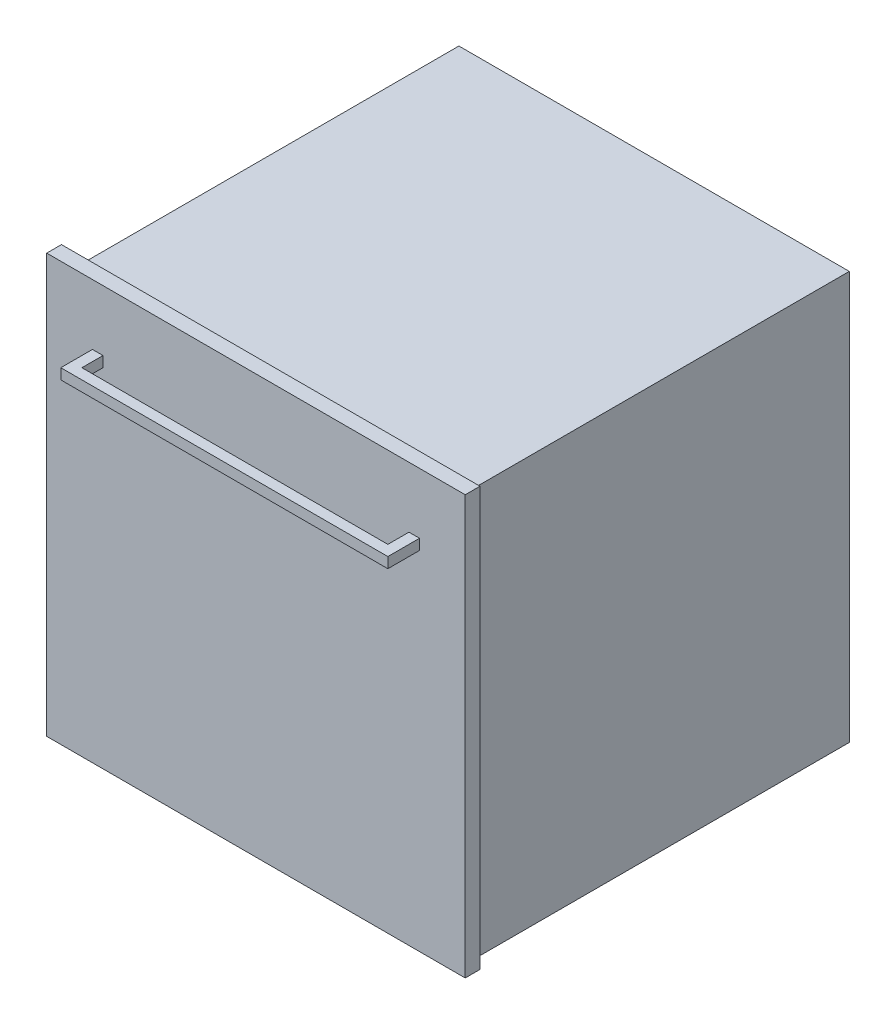
ISO-10303-21;
HEADER;
FILE_DESCRIPTION(('STEP AP214'),'2;1');
FILE_NAME('part.step','',(''),(''),'','','');
FILE_SCHEMA(('AUTOMOTIVE_DESIGN { 1 0 10303 214 1 1 1 1 }'));
ENDSEC;
DATA;
#1=APPLICATION_CONTEXT('core data for automotive mechanical design processes');
#2=APPLICATION_PROTOCOL_DEFINITION('international standard','automotive_design',2000,#1);
#3=PRODUCT_CONTEXT('',#1,'mechanical');
#4=PRODUCT('Part','Part','',(#3));
#5=PRODUCT_RELATED_PRODUCT_CATEGORY('part','',(#4));
#6=PRODUCT_DEFINITION_FORMATION('','',#4);
#7=PRODUCT_DEFINITION_CONTEXT('part definition',#1,'design');
#8=PRODUCT_DEFINITION('design','',#6,#7);
#9=PRODUCT_DEFINITION_SHAPE('','',#8);
#10=(LENGTH_UNIT() NAMED_UNIT(*) SI_UNIT(.MILLI.,.METRE.));
#11=(NAMED_UNIT(*) PLANE_ANGLE_UNIT() SI_UNIT($,.RADIAN.));
#12=(NAMED_UNIT(*) SI_UNIT($,.STERADIAN.) SOLID_ANGLE_UNIT());
#13=UNCERTAINTY_MEASURE_WITH_UNIT(LENGTH_MEASURE(1.E-05),#10,'distance_accuracy_value','');
#14=(GEOMETRIC_REPRESENTATION_CONTEXT(3) GLOBAL_UNCERTAINTY_ASSIGNED_CONTEXT((#13)) GLOBAL_UNIT_ASSIGNED_CONTEXT((#10,
#11,#12)) REPRESENTATION_CONTEXT('',''));
#15=CARTESIAN_POINT('',(0.,0.,0.));
#16=DIRECTION('',(0.,0.,1.));
#17=DIRECTION('',(1.,0.,0.));
#18=AXIS2_PLACEMENT_3D('',#15,#16,#17);
#19=CARTESIAN_POINT('',(0.,0.,293.5));
#20=DIRECTION('',(0.,0.,1.));
#21=DIRECTION('',(1.,0.,0.));
#22=AXIS2_PLACEMENT_3D('',#19,#20,#21);
#23=PLANE('',#22);
#24=DIRECTION('',(0.,-1.,0.));
#25=VECTOR('',#24,1.);
#26=CARTESIAN_POINT('',(-297.5,2.99999999999989,293.5));
#27=LINE('',#26,#25);
#28=CARTESIAN_POINT('',(-297.5,598.,293.5));
#29=VERTEX_POINT('',#28);
#30=CARTESIAN_POINT('',(-297.5,2.99999999999989,293.5));
#31=VERTEX_POINT('',#30);
#32=EDGE_CURVE('E226',#29,#31,#27,.T.);
#33=ORIENTED_EDGE('',*,*,#32,.T.);
#34=DIRECTION('',(1.,0.,0.));
#35=VECTOR('',#34,1.);
#36=CARTESIAN_POINT('',(297.5,2.99999999999996,293.5));
#37=LINE('',#36,#35);
#38=CARTESIAN_POINT('',(297.5,2.99999999999996,293.5));
#39=VERTEX_POINT('',#38);
#40=EDGE_CURVE('E229',#31,#39,#37,.T.);
#41=ORIENTED_EDGE('',*,*,#40,.T.);
#42=DIRECTION('',(0.,1.,0.));
#43=VECTOR('',#42,1.);
#44=CARTESIAN_POINT('',(297.5,2.99999999999996,293.5));
#45=LINE('',#44,#43);
#46=CARTESIAN_POINT('',(297.5,598.,293.5));
#47=VERTEX_POINT('',#46);
#48=EDGE_CURVE('E232',#39,#47,#45,.T.);
#49=ORIENTED_EDGE('',*,*,#48,.T.);
#50=DIRECTION('',(-1.,0.,0.));
#51=VECTOR('',#50,1.);
#52=CARTESIAN_POINT('',(297.5,598.,293.5));
#53=LINE('',#52,#51);
#54=EDGE_CURVE('E234',#47,#29,#53,.T.);
#55=ORIENTED_EDGE('',*,*,#54,.T.);
#56=EDGE_LOOP('',(#33,#41,#49,#55));
#57=FACE_BOUND('',#56,.T.);
#58=DIRECTION('',(-1.,0.,0.));
#59=VECTOR('',#58,1.);
#60=CARTESIAN_POINT('',(-232.5,511.913440556,293.5));
#61=LINE('',#60,#59);
#62=CARTESIAN_POINT('',(-217.5,511.913440556,293.5));
#63=VERTEX_POINT('',#62);
#64=CARTESIAN_POINT('',(-232.5,511.913440556,293.5));
#65=VERTEX_POINT('',#64);
#66=EDGE_CURVE('E216',#63,#65,#61,.T.);
#67=ORIENTED_EDGE('',*,*,#66,.F.);
#68=DIRECTION('',(0.,1.,0.));
#69=VECTOR('',#68,1.);
#70=CARTESIAN_POINT('',(-217.5,511.913440556,293.5));
#71=LINE('',#70,#69);
#72=CARTESIAN_POINT('',(-217.5,496.913440556,293.5));
#73=VERTEX_POINT('',#72);
#74=EDGE_CURVE('E209',#73,#63,#71,.T.);
#75=ORIENTED_EDGE('',*,*,#74,.F.);
#76=DIRECTION('',(1.,0.,0.));
#77=VECTOR('',#76,1.);
#78=CARTESIAN_POINT('',(-232.5,496.913440556,293.5));
#79=LINE('',#78,#77);
#80=CARTESIAN_POINT('',(-232.5,496.913440556,293.5));
#81=VERTEX_POINT('',#80);
#82=EDGE_CURVE('E213',#81,#73,#79,.T.);
#83=ORIENTED_EDGE('',*,*,#82,.F.);
#84=DIRECTION('',(0.,-1.,0.));
#85=VECTOR('',#84,1.);
#86=CARTESIAN_POINT('',(-232.5,511.913440556,293.5));
#87=LINE('',#86,#85);
#88=EDGE_CURVE('E162',#65,#81,#87,.T.);
#89=ORIENTED_EDGE('',*,*,#88,.F.);
#90=EDGE_LOOP('',(#67,#75,#83,#89));
#91=FACE_BOUND('',#90,.T.);
#92=DIRECTION('',(-1.,0.,0.));
#93=VECTOR('',#92,1.);
#94=CARTESIAN_POINT('',(217.5,511.913440556,293.5));
#95=LINE('',#94,#93);
#96=CARTESIAN_POINT('',(232.5,511.913440556,293.5));
#97=VERTEX_POINT('',#96);
#98=CARTESIAN_POINT('',(217.5,511.913440556,293.5));
#99=VERTEX_POINT('',#98);
#100=EDGE_CURVE('E197',#97,#99,#95,.T.);
#101=ORIENTED_EDGE('',*,*,#100,.F.);
#102=DIRECTION('',(0.,1.,0.));
#103=VECTOR('',#102,1.);
#104=CARTESIAN_POINT('',(232.5,511.913440556,293.5));
#105=LINE('',#104,#103);
#106=CARTESIAN_POINT('',(232.5,496.913440556,293.5));
#107=VERTEX_POINT('',#106);
#108=EDGE_CURVE('E189',#107,#97,#105,.T.);
#109=ORIENTED_EDGE('',*,*,#108,.F.);
#110=DIRECTION('',(1.,0.,0.));
#111=VECTOR('',#110,1.);
#112=CARTESIAN_POINT('',(217.5,496.913440556,293.5));
#113=LINE('',#112,#111);
#114=CARTESIAN_POINT('',(217.5,496.913440556,293.5));
#115=VERTEX_POINT('',#114);
#116=EDGE_CURVE('E194',#115,#107,#113,.T.);
#117=ORIENTED_EDGE('',*,*,#116,.F.);
#118=DIRECTION('',(0.,-1.,0.));
#119=VECTOR('',#118,1.);
#120=CARTESIAN_POINT('',(217.5,511.913440556,293.5));
#121=LINE('',#120,#119);
#122=EDGE_CURVE('E199',#99,#115,#121,.T.);
#123=ORIENTED_EDGE('',*,*,#122,.F.);
#124=EDGE_LOOP('',(#101,#109,#117,#123));
#125=FACE_BOUND('',#124,.T.);
#126=ADVANCED_FACE('F37',(#57,#91,#125),#23,.T.);
#127=CARTESIAN_POINT('',(277.5,580.,272.5));
#128=DIRECTION('',(0.,0.,-1.));
#129=DIRECTION('',(-1.,0.,0.));
#130=AXIS2_PLACEMENT_3D('',#127,#128,#129);
#131=PLANE('',#130);
#132=DIRECTION('',(1.,0.,0.));
#133=VECTOR('',#132,1.);
#134=CARTESIAN_POINT('',(297.5,2.99999999999996,272.5));
#135=LINE('',#134,#133);
#136=CARTESIAN_POINT('',(-277.5,2.99999999999989,272.5));
#137=VERTEX_POINT('',#136);
#138=CARTESIAN_POINT('',(277.5,2.99999999999996,272.5));
#139=VERTEX_POINT('',#138);
#140=EDGE_CURVE('E11',#137,#139,#135,.T.);
#141=ORIENTED_EDGE('',*,*,#140,.F.);
#142=DIRECTION('',(0.,-1.,0.));
#143=VECTOR('',#142,1.);
#144=CARTESIAN_POINT('',(-277.5,580.,272.5));
#145=LINE('',#144,#143);
#146=CARTESIAN_POINT('',(-277.5,0.,272.5));
#147=VERTEX_POINT('',#146);
#148=EDGE_CURVE('E279',#137,#147,#145,.T.);
#149=ORIENTED_EDGE('',*,*,#148,.T.);
#150=DIRECTION('',(1.,0.,0.));
#151=VECTOR('',#150,1.);
#152=CARTESIAN_POINT('',(277.5,0.,272.5));
#153=LINE('',#152,#151);
#154=CARTESIAN_POINT('',(277.5,0.,272.5));
#155=VERTEX_POINT('',#154);
#156=EDGE_CURVE('E267',#147,#155,#153,.T.);
#157=ORIENTED_EDGE('',*,*,#156,.T.);
#158=DIRECTION('',(0.,-1.,0.));
#159=VECTOR('',#158,1.);
#160=CARTESIAN_POINT('',(277.5,580.,272.5));
#161=LINE('',#160,#159);
#162=EDGE_CURVE('E277',#139,#155,#161,.T.);
#163=ORIENTED_EDGE('',*,*,#162,.F.);
#164=EDGE_LOOP('',(#141,#149,#157,#163));
#165=FACE_BOUND('',#164,.T.);
#166=ADVANCED_FACE('F290',(#165),#131,.F.);
#167=CARTESIAN_POINT('',(-277.5,580.,272.5));
#168=DIRECTION('',(1.,0.,0.));
#169=DIRECTION('',(0.,0.,-1.));
#170=AXIS2_PLACEMENT_3D('',#167,#168,#169);
#171=PLANE('',#170);
#172=DIRECTION('',(0.,0.,1.));
#173=VECTOR('',#172,1.);
#174=CARTESIAN_POINT('',(-277.5,0.,272.5));
#175=LINE('',#174,#173);
#176=CARTESIAN_POINT('',(-277.5,0.,-272.5));
#177=VERTEX_POINT('',#176);
#178=EDGE_CURVE('E254',#177,#147,#175,.T.);
#179=ORIENTED_EDGE('',*,*,#178,.T.);
#180=ORIENTED_EDGE('',*,*,#148,.F.);
#181=CARTESIAN_POINT('',(-277.5,580.,272.5));
#182=VERTEX_POINT('',#181);
#183=EDGE_CURVE('E41',#182,#137,#145,.T.);
#184=ORIENTED_EDGE('',*,*,#183,.F.);
#185=DIRECTION('',(0.,0.,1.));
#186=VECTOR('',#185,1.);
#187=CARTESIAN_POINT('',(-277.5,580.,272.5));
#188=LINE('',#187,#186);
#189=CARTESIAN_POINT('',(-277.5,580.,-272.5));
#190=VERTEX_POINT('',#189);
#191=EDGE_CURVE('E255',#190,#182,#188,.T.);
#192=ORIENTED_EDGE('',*,*,#191,.F.);
#193=DIRECTION('',(0.,-1.,0.));
#194=VECTOR('',#193,1.);
#195=CARTESIAN_POINT('',(-277.5,580.,-272.5));
#196=LINE('',#195,#194);
#197=EDGE_CURVE('E264',#190,#177,#196,.T.);
#198=ORIENTED_EDGE('',*,*,#197,.T.);
#199=EDGE_LOOP('',(#179,#180,#184,#192,#198));
#200=FACE_BOUND('',#199,.T.);
#201=ADVANCED_FACE('F39',(#200),#171,.F.);
#202=CARTESIAN_POINT('',(277.5,580.,272.5));
#203=DIRECTION('',(-1.,0.,0.));
#204=DIRECTION('',(0.,0.,1.));
#205=AXIS2_PLACEMENT_3D('',#202,#203,#204);
#206=PLANE('',#205);
#207=DIRECTION('',(0.,0.,-1.));
#208=VECTOR('',#207,1.);
#209=CARTESIAN_POINT('',(277.5,0.,272.5));
#210=LINE('',#209,#208);
#211=CARTESIAN_POINT('',(277.5,0.,-272.5));
#212=VERTEX_POINT('',#211);
#213=EDGE_CURVE('E270',#155,#212,#210,.T.);
#214=ORIENTED_EDGE('',*,*,#213,.T.);
#215=DIRECTION('',(0.,-1.,0.));
#216=VECTOR('',#215,1.);
#217=CARTESIAN_POINT('',(277.5,580.,-272.5));
#218=LINE('',#217,#216);
#219=CARTESIAN_POINT('',(277.5,580.,-272.5));
#220=VERTEX_POINT('',#219);
#221=EDGE_CURVE('E275',#220,#212,#218,.T.);
#222=ORIENTED_EDGE('',*,*,#221,.F.);
#223=DIRECTION('',(0.,0.,-1.));
#224=VECTOR('',#223,1.);
#225=CARTESIAN_POINT('',(277.5,580.,272.5));
#226=LINE('',#225,#224);
#227=CARTESIAN_POINT('',(277.5,580.,272.5));
#228=VERTEX_POINT('',#227);
#229=EDGE_CURVE('E260',#228,#220,#226,.T.);
#230=ORIENTED_EDGE('',*,*,#229,.F.);
#231=EDGE_CURVE('E278',#228,#139,#161,.T.);
#232=ORIENTED_EDGE('',*,*,#231,.T.);
#233=ORIENTED_EDGE('',*,*,#162,.T.);
#234=EDGE_LOOP('',(#214,#222,#230,#232,#233));
#235=FACE_BOUND('',#234,.T.);
#236=ADVANCED_FACE('F284',(#235),#206,.F.);
#237=CARTESIAN_POINT('',(277.5,580.,-272.5));
#238=DIRECTION('',(0.,0.,1.));
#239=DIRECTION('',(1.,0.,0.));
#240=AXIS2_PLACEMENT_3D('',#237,#238,#239);
#241=PLANE('',#240);
#242=DIRECTION('',(-1.,0.,0.));
#243=VECTOR('',#242,1.);
#244=CARTESIAN_POINT('',(277.5,0.,-272.5));
#245=LINE('',#244,#243);
#246=EDGE_CURVE('E258',#212,#177,#245,.T.);
#247=ORIENTED_EDGE('',*,*,#246,.T.);
#248=ORIENTED_EDGE('',*,*,#197,.F.);
#249=DIRECTION('',(-1.,0.,0.));
#250=VECTOR('',#249,1.);
#251=CARTESIAN_POINT('',(277.5,580.,-272.5));
#252=LINE('',#251,#250);
#253=EDGE_CURVE('E262',#220,#190,#252,.T.);
#254=ORIENTED_EDGE('',*,*,#253,.F.);
#255=ORIENTED_EDGE('',*,*,#221,.T.);
#256=EDGE_LOOP('',(#247,#248,#254,#255));
#257=FACE_BOUND('',#256,.T.);
#258=ADVANCED_FACE('F298',(#257),#241,.F.);
#259=CARTESIAN_POINT('',(0.,580.,0.));
#260=DIRECTION('',(0.,1.,0.));
#261=DIRECTION('',(0.,0.,1.));
#262=AXIS2_PLACEMENT_3D('',#259,#260,#261);
#263=PLANE('',#262);
#264=ORIENTED_EDGE('',*,*,#191,.T.);
#265=DIRECTION('',(1.,0.,0.));
#266=VECTOR('',#265,1.);
#267=CARTESIAN_POINT('',(277.5,580.,272.5));
#268=LINE('',#267,#266);
#269=EDGE_CURVE('E257',#182,#228,#268,.T.);
#270=ORIENTED_EDGE('',*,*,#269,.T.);
#271=ORIENTED_EDGE('',*,*,#229,.T.);
#272=ORIENTED_EDGE('',*,*,#253,.T.);
#273=EDGE_LOOP('',(#264,#270,#271,#272));
#274=FACE_BOUND('',#273,.T.);
#275=ADVANCED_FACE('F306',(#274),#263,.T.);
#276=CARTESIAN_POINT('',(0.,0.,0.));
#277=DIRECTION('',(0.,1.,0.));
#278=DIRECTION('',(0.,0.,1.));
#279=AXIS2_PLACEMENT_3D('',#276,#277,#278);
#280=PLANE('',#279);
#281=ORIENTED_EDGE('',*,*,#178,.F.);
#282=ORIENTED_EDGE('',*,*,#246,.F.);
#283=ORIENTED_EDGE('',*,*,#213,.F.);
#284=ORIENTED_EDGE('',*,*,#156,.F.);
#285=EDGE_LOOP('',(#281,#282,#283,#284));
#286=FACE_BOUND('',#285,.T.);
#287=ADVANCED_FACE('F295',(#286),#280,.F.);
#288=CARTESIAN_POINT('',(-297.5,2.99999999999989,293.5));
#289=DIRECTION('',(1.,0.,0.));
#290=DIRECTION('',(0.,1.,0.));
#291=AXIS2_PLACEMENT_3D('',#288,#289,#290);
#292=PLANE('',#291);
#293=DIRECTION('',(0.,-1.,0.));
#294=VECTOR('',#293,1.);
#295=CARTESIAN_POINT('',(-297.5,2.99999999999989,272.5));
#296=LINE('',#295,#294);
#297=CARTESIAN_POINT('',(-297.5,598.,272.5));
#298=VERTEX_POINT('',#297);
#299=CARTESIAN_POINT('',(-297.5,2.99999999999989,272.5));
#300=VERTEX_POINT('',#299);
#301=EDGE_CURVE('E225',#298,#300,#296,.T.);
#302=ORIENTED_EDGE('',*,*,#301,.T.);
#303=DIRECTION('',(0.,0.,-1.));
#304=VECTOR('',#303,1.);
#305=CARTESIAN_POINT('',(-297.5,2.99999999999989,293.5));
#306=LINE('',#305,#304);
#307=EDGE_CURVE('E251',#31,#300,#306,.T.);
#308=ORIENTED_EDGE('',*,*,#307,.F.);
#309=ORIENTED_EDGE('',*,*,#32,.F.);
#310=DIRECTION('',(0.,0.,-1.));
#311=VECTOR('',#310,1.);
#312=CARTESIAN_POINT('',(-297.5,598.,293.5));
#313=LINE('',#312,#311);
#314=EDGE_CURVE('E236',#29,#298,#313,.T.);
#315=ORIENTED_EDGE('',*,*,#314,.T.);
#316=EDGE_LOOP('',(#302,#308,#309,#315));
#317=FACE_BOUND('',#316,.T.);
#318=ADVANCED_FACE('F318',(#317),#292,.F.);
#319=CARTESIAN_POINT('',(297.5,2.99999999999996,293.5));
#320=DIRECTION('',(0.,1.,0.));
#321=DIRECTION('',(-1.,0.,0.));
#322=AXIS2_PLACEMENT_3D('',#319,#320,#321);
#323=PLANE('',#322);
#324=EDGE_CURVE('E47',#300,#137,#135,.T.);
#325=ORIENTED_EDGE('',*,*,#324,.T.);
#326=ORIENTED_EDGE('',*,*,#140,.T.);
#327=CARTESIAN_POINT('',(297.5,2.99999999999996,272.5));
#328=VERTEX_POINT('',#327);
#329=EDGE_CURVE('E48',#139,#328,#135,.T.);
#330=ORIENTED_EDGE('',*,*,#329,.T.);
#331=DIRECTION('',(0.,0.,-1.));
#332=VECTOR('',#331,1.);
#333=CARTESIAN_POINT('',(297.5,2.99999999999996,293.5));
#334=LINE('',#333,#332);
#335=EDGE_CURVE('E248',#39,#328,#334,.T.);
#336=ORIENTED_EDGE('',*,*,#335,.F.);
#337=ORIENTED_EDGE('',*,*,#40,.F.);
#338=ORIENTED_EDGE('',*,*,#307,.T.);
#339=EDGE_LOOP('',(#325,#326,#330,#336,#337,#338));
#340=FACE_BOUND('',#339,.T.);
#341=ADVANCED_FACE('F313',(#340),#323,.F.);
#342=CARTESIAN_POINT('',(297.5,2.99999999999996,293.5));
#343=DIRECTION('',(-1.,0.,0.));
#344=DIRECTION('',(0.,0.,1.));
#345=AXIS2_PLACEMENT_3D('',#342,#343,#344);
#346=PLANE('',#345);
#347=DIRECTION('',(0.,1.,0.));
#348=VECTOR('',#347,1.);
#349=CARTESIAN_POINT('',(297.5,2.99999999999996,272.5));
#350=LINE('',#349,#348);
#351=CARTESIAN_POINT('',(297.5,598.,272.5));
#352=VERTEX_POINT('',#351);
#353=EDGE_CURVE('E240',#328,#352,#350,.T.);
#354=ORIENTED_EDGE('',*,*,#353,.T.);
#355=DIRECTION('',(0.,0.,-1.));
#356=VECTOR('',#355,1.);
#357=CARTESIAN_POINT('',(297.5,598.,293.5));
#358=LINE('',#357,#356);
#359=EDGE_CURVE('E245',#47,#352,#358,.T.);
#360=ORIENTED_EDGE('',*,*,#359,.F.);
#361=ORIENTED_EDGE('',*,*,#48,.F.);
#362=ORIENTED_EDGE('',*,*,#335,.T.);
#363=EDGE_LOOP('',(#354,#360,#361,#362));
#364=FACE_BOUND('',#363,.T.);
#365=ADVANCED_FACE('F326',(#364),#346,.F.);
#366=CARTESIAN_POINT('',(297.5,598.,293.5));
#367=DIRECTION('',(0.,-1.,0.));
#368=DIRECTION('',(1.,0.,0.));
#369=AXIS2_PLACEMENT_3D('',#366,#367,#368);
#370=PLANE('',#369);
#371=DIRECTION('',(-1.,0.,0.));
#372=VECTOR('',#371,1.);
#373=CARTESIAN_POINT('',(297.5,598.,272.5));
#374=LINE('',#373,#372);
#375=EDGE_CURVE('E230',#352,#298,#374,.T.);
#376=ORIENTED_EDGE('',*,*,#375,.T.);
#377=ORIENTED_EDGE('',*,*,#314,.F.);
#378=ORIENTED_EDGE('',*,*,#54,.F.);
#379=ORIENTED_EDGE('',*,*,#359,.T.);
#380=EDGE_LOOP('',(#376,#377,#378,#379));
#381=FACE_BOUND('',#380,.T.);
#382=ADVANCED_FACE('F322',(#381),#370,.F.);
#383=CARTESIAN_POINT('',(0.,0.,272.5));
#384=DIRECTION('',(0.,0.,1.));
#385=DIRECTION('',(1.,0.,0.));
#386=AXIS2_PLACEMENT_3D('',#383,#384,#385);
#387=PLANE('',#386);
#388=ORIENTED_EDGE('',*,*,#231,.F.);
#389=ORIENTED_EDGE('',*,*,#269,.F.);
#390=ORIENTED_EDGE('',*,*,#183,.T.);
#391=ORIENTED_EDGE('',*,*,#324,.F.);
#392=ORIENTED_EDGE('',*,*,#301,.F.);
#393=ORIENTED_EDGE('',*,*,#375,.F.);
#394=ORIENTED_EDGE('',*,*,#353,.F.);
#395=ORIENTED_EDGE('',*,*,#329,.F.);
#396=EDGE_LOOP('',(#388,#389,#390,#391,#392,#393,#394,#395));
#397=FACE_BOUND('',#396,.T.);
#398=ADVANCED_FACE('F308',(#397),#387,.F.);
#399=CARTESIAN_POINT('',(-217.5,511.913440556,323.5));
#400=DIRECTION('',(-1.,0.,0.));
#401=DIRECTION('',(0.,0.,1.));
#402=AXIS2_PLACEMENT_3D('',#399,#400,#401);
#403=PLANE('',#402);
#404=ORIENTED_EDGE('',*,*,#74,.T.);
#405=DIRECTION('',(0.,0.,-1.));
#406=VECTOR('',#405,1.);
#407=CARTESIAN_POINT('',(-217.5,511.913440556,323.5));
#408=LINE('',#407,#406);
#409=CARTESIAN_POINT('',(-217.5,511.913440556,323.5));
#410=VERTEX_POINT('',#409);
#411=EDGE_CURVE('E223',#410,#63,#408,.T.);
#412=ORIENTED_EDGE('',*,*,#411,.F.);
#413=DIRECTION('',(0.,1.,0.));
#414=VECTOR('',#413,1.);
#415=CARTESIAN_POINT('',(-217.5,511.913440556,323.5));
#416=LINE('',#415,#414);
#417=CARTESIAN_POINT('',(-217.5,496.913440556,323.5));
#418=VERTEX_POINT('',#417);
#419=EDGE_CURVE('E210',#418,#410,#416,.T.);
#420=ORIENTED_EDGE('',*,*,#419,.F.);
#421=DIRECTION('',(0.,0.,-1.));
#422=VECTOR('',#421,1.);
#423=CARTESIAN_POINT('',(-217.5,496.913440556,323.5));
#424=LINE('',#423,#422);
#425=EDGE_CURVE('E165',#418,#73,#424,.T.);
#426=ORIENTED_EDGE('',*,*,#425,.T.);
#427=EDGE_LOOP('',(#404,#412,#420,#426));
#428=FACE_BOUND('',#427,.T.);
#429=ADVANCED_FACE('F349',(#428),#403,.F.);
#430=CARTESIAN_POINT('',(-232.5,511.913440556,323.5));
#431=DIRECTION('',(0.,-1.,0.));
#432=DIRECTION('',(0.,0.,-1.));
#433=AXIS2_PLACEMENT_3D('',#430,#431,#432);
#434=PLANE('',#433);
#435=ORIENTED_EDGE('',*,*,#66,.T.);
#436=DIRECTION('',(0.,0.,-1.));
#437=VECTOR('',#436,1.);
#438=CARTESIAN_POINT('',(-232.5,511.913440556,323.5));
#439=LINE('',#438,#437);
#440=CARTESIAN_POINT('',(-232.5,511.913440556,338.5));
#441=VERTEX_POINT('',#440);
#442=EDGE_CURVE('E164',#441,#65,#439,.T.);
#443=ORIENTED_EDGE('',*,*,#442,.F.);
#444=DIRECTION('',(-1.,0.,0.));
#445=VECTOR('',#444,1.);
#446=CARTESIAN_POINT('',(232.5,511.913440556,338.5));
#447=LINE('',#446,#445);
#448=CARTESIAN_POINT('',(232.5,511.913440556,338.5));
#449=VERTEX_POINT('',#448);
#450=EDGE_CURVE('E180',#449,#441,#447,.T.);
#451=ORIENTED_EDGE('',*,*,#450,.F.);
#452=DIRECTION('',(0.,0.,-1.));
#453=VECTOR('',#452,1.);
#454=CARTESIAN_POINT('',(232.5,511.913440556,323.5));
#455=LINE('',#454,#453);
#456=EDGE_CURVE('E207',#449,#97,#455,.T.);
#457=ORIENTED_EDGE('',*,*,#456,.T.);
#458=ORIENTED_EDGE('',*,*,#100,.T.);
#459=DIRECTION('',(0.,0.,-1.));
#460=VECTOR('',#459,1.);
#461=CARTESIAN_POINT('',(217.5,511.913440556,323.5));
#462=LINE('',#461,#460);
#463=CARTESIAN_POINT('',(217.5,511.913440556,323.5));
#464=VERTEX_POINT('',#463);
#465=EDGE_CURVE('E204',#464,#99,#462,.T.);
#466=ORIENTED_EDGE('',*,*,#465,.F.);
#467=DIRECTION('',(-1.,0.,0.));
#468=VECTOR('',#467,1.);
#469=CARTESIAN_POINT('',(232.5,511.913440556,323.5));
#470=LINE('',#469,#468);
#471=EDGE_CURVE('E181',#464,#410,#470,.T.);
#472=ORIENTED_EDGE('',*,*,#471,.T.);
#473=ORIENTED_EDGE('',*,*,#411,.T.);
#474=EDGE_LOOP('',(#435,#443,#451,#457,#458,#466,#472,#473));
#475=FACE_BOUND('',#474,.T.);
#476=ADVANCED_FACE('F339',(#475),#434,.F.);
#477=CARTESIAN_POINT('',(-232.5,511.913440556,323.5));
#478=DIRECTION('',(1.,0.,0.));
#479=DIRECTION('',(0.,0.,-1.));
#480=AXIS2_PLACEMENT_3D('',#477,#478,#479);
#481=PLANE('',#480);
#482=ORIENTED_EDGE('',*,*,#88,.T.);
#483=DIRECTION('',(0.,0.,-1.));
#484=VECTOR('',#483,1.);
#485=CARTESIAN_POINT('',(-232.5,496.913440556,323.5));
#486=LINE('',#485,#484);
#487=CARTESIAN_POINT('',(-232.5,496.913440556,338.5));
#488=VERTEX_POINT('',#487);
#489=EDGE_CURVE('E62',#488,#81,#486,.T.);
#490=ORIENTED_EDGE('',*,*,#489,.F.);
#491=DIRECTION('',(0.,-1.,0.));
#492=VECTOR('',#491,1.);
#493=CARTESIAN_POINT('',(-232.5,511.913440556,338.5));
#494=LINE('',#493,#492);
#495=EDGE_CURVE('E160',#441,#488,#494,.T.);
#496=ORIENTED_EDGE('',*,*,#495,.F.);
#497=ORIENTED_EDGE('',*,*,#442,.T.);
#498=EDGE_LOOP('',(#482,#490,#496,#497));
#499=FACE_BOUND('',#498,.T.);
#500=ADVANCED_FACE('F157',(#499),#481,.F.);
#501=CARTESIAN_POINT('',(-232.5,496.913440556,323.5));
#502=DIRECTION('',(0.,1.,0.));
#503=DIRECTION('',(0.,0.,1.));
#504=AXIS2_PLACEMENT_3D('',#501,#502,#503);
#505=PLANE('',#504);
#506=ORIENTED_EDGE('',*,*,#82,.T.);
#507=ORIENTED_EDGE('',*,*,#425,.F.);
#508=DIRECTION('',(1.,0.,0.));
#509=VECTOR('',#508,1.);
#510=CARTESIAN_POINT('',(-232.5,496.913440556,323.5));
#511=LINE('',#510,#509);
#512=CARTESIAN_POINT('',(217.5,496.913440556,323.5));
#513=VERTEX_POINT('',#512);
#514=EDGE_CURVE('E184',#418,#513,#511,.T.);
#515=ORIENTED_EDGE('',*,*,#514,.T.);
#516=DIRECTION('',(0.,0.,-1.));
#517=VECTOR('',#516,1.);
#518=CARTESIAN_POINT('',(217.5,496.913440556,323.5));
#519=LINE('',#518,#517);
#520=EDGE_CURVE('E55',#513,#115,#519,.T.);
#521=ORIENTED_EDGE('',*,*,#520,.T.);
#522=ORIENTED_EDGE('',*,*,#116,.T.);
#523=DIRECTION('',(0.,0.,-1.));
#524=VECTOR('',#523,1.);
#525=CARTESIAN_POINT('',(232.5,496.913440556,323.5));
#526=LINE('',#525,#524);
#527=CARTESIAN_POINT('',(232.5,496.913440556,338.5));
#528=VERTEX_POINT('',#527);
#529=EDGE_CURVE('E171',#528,#107,#526,.T.);
#530=ORIENTED_EDGE('',*,*,#529,.F.);
#531=DIRECTION('',(1.,0.,0.));
#532=VECTOR('',#531,1.);
#533=CARTESIAN_POINT('',(-232.5,496.913440556,338.5));
#534=LINE('',#533,#532);
#535=EDGE_CURVE('E168',#488,#528,#534,.T.);
#536=ORIENTED_EDGE('',*,*,#535,.F.);
#537=ORIENTED_EDGE('',*,*,#489,.T.);
#538=EDGE_LOOP('',(#506,#507,#515,#521,#522,#530,#536,#537));
#539=FACE_BOUND('',#538,.T.);
#540=ADVANCED_FACE('F169',(#539),#505,.F.);
#541=CARTESIAN_POINT('',(232.5,511.913440556,323.5));
#542=DIRECTION('',(-1.,0.,0.));
#543=DIRECTION('',(0.,0.,1.));
#544=AXIS2_PLACEMENT_3D('',#541,#542,#543);
#545=PLANE('',#544);
#546=ORIENTED_EDGE('',*,*,#108,.T.);
#547=ORIENTED_EDGE('',*,*,#456,.F.);
#548=DIRECTION('',(0.,1.,0.));
#549=VECTOR('',#548,1.);
#550=CARTESIAN_POINT('',(232.5,496.913440556,338.5));
#551=LINE('',#550,#549);
#552=EDGE_CURVE('E175',#528,#449,#551,.T.);
#553=ORIENTED_EDGE('',*,*,#552,.F.);
#554=ORIENTED_EDGE('',*,*,#529,.T.);
#555=EDGE_LOOP('',(#546,#547,#553,#554));
#556=FACE_BOUND('',#555,.T.);
#557=ADVANCED_FACE('F452',(#556),#545,.F.);
#558=CARTESIAN_POINT('',(217.5,511.913440556,323.5));
#559=DIRECTION('',(1.,0.,0.));
#560=DIRECTION('',(0.,0.,-1.));
#561=AXIS2_PLACEMENT_3D('',#558,#559,#560);
#562=PLANE('',#561);
#563=ORIENTED_EDGE('',*,*,#122,.T.);
#564=ORIENTED_EDGE('',*,*,#520,.F.);
#565=DIRECTION('',(0.,-1.,0.));
#566=VECTOR('',#565,1.);
#567=CARTESIAN_POINT('',(217.5,511.913440556,323.5));
#568=LINE('',#567,#566);
#569=EDGE_CURVE('E191',#464,#513,#568,.T.);
#570=ORIENTED_EDGE('',*,*,#569,.F.);
#571=ORIENTED_EDGE('',*,*,#465,.T.);
#572=EDGE_LOOP('',(#563,#564,#570,#571));
#573=FACE_BOUND('',#572,.T.);
#574=ADVANCED_FACE('F342',(#573),#562,.F.);
#575=CARTESIAN_POINT('',(0.,0.,323.5));
#576=DIRECTION('',(0.,0.,1.));
#577=DIRECTION('',(1.,0.,0.));
#578=AXIS2_PLACEMENT_3D('',#575,#576,#577);
#579=PLANE('',#578);
#580=ORIENTED_EDGE('',*,*,#514,.F.);
#581=ORIENTED_EDGE('',*,*,#419,.T.);
#582=ORIENTED_EDGE('',*,*,#471,.F.);
#583=ORIENTED_EDGE('',*,*,#569,.T.);
#584=EDGE_LOOP('',(#580,#581,#582,#583));
#585=FACE_BOUND('',#584,.T.);
#586=ADVANCED_FACE('F346',(#585),#579,.F.);
#587=CARTESIAN_POINT('',(0.,0.,338.5));
#588=DIRECTION('',(0.,0.,1.));
#589=DIRECTION('',(1.,0.,0.));
#590=AXIS2_PLACEMENT_3D('',#587,#588,#589);
#591=PLANE('',#590);
#592=ORIENTED_EDGE('',*,*,#495,.T.);
#593=ORIENTED_EDGE('',*,*,#535,.T.);
#594=ORIENTED_EDGE('',*,*,#552,.T.);
#595=ORIENTED_EDGE('',*,*,#450,.T.);
#596=EDGE_LOOP('',(#592,#593,#594,#595));
#597=FACE_BOUND('',#596,.T.);
#598=ADVANCED_FACE('F178',(#597),#591,.T.);
#599=CLOSED_SHELL('',(#126,#166,#201,#236,#258,#275,#287,#318,#341,#365,#382,#398,#429,#476,
#500,#540,#557,#574,#586,#598));
#600=MANIFOLD_SOLID_BREP('B2',#599);
#601=ADVANCED_BREP_SHAPE_REPRESENTATION('',(#18,#600),#14);
#602=SHAPE_DEFINITION_REPRESENTATION(#9,#601);
ENDSEC;
END-ISO-10303-21;
